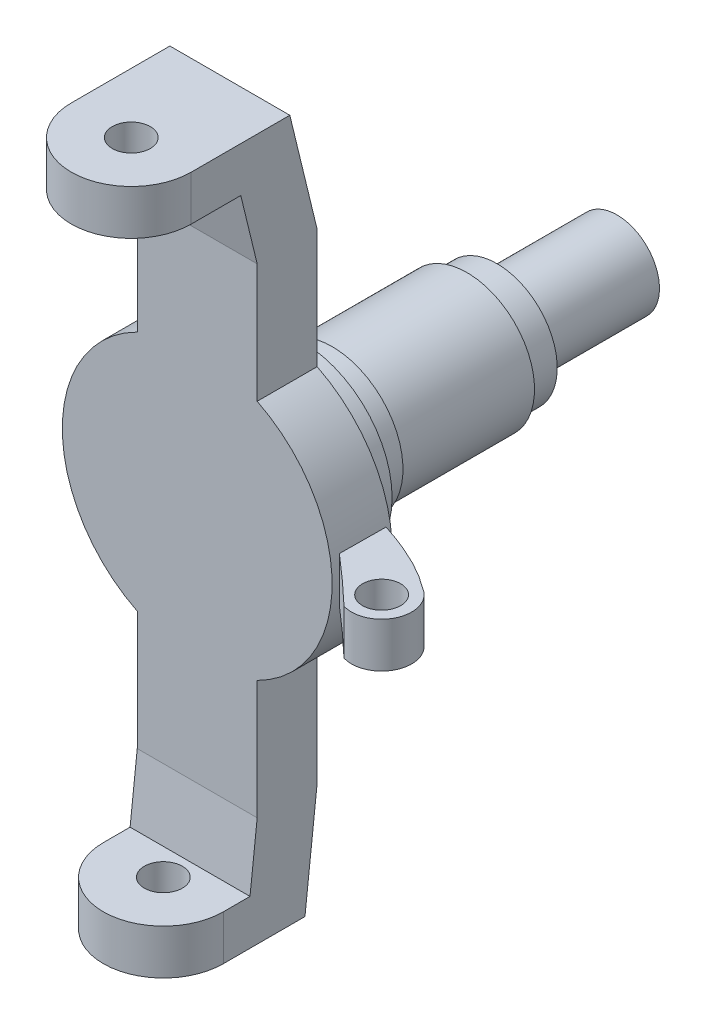
ISO-10303-21;
HEADER;
FILE_DESCRIPTION(('STEP AP214'),'2;1');
FILE_NAME('part.step','',(''),(''),'','','');
FILE_SCHEMA(('AUTOMOTIVE_DESIGN { 1 0 10303 214 1 1 1 1 }'));
ENDSEC;
DATA;
#1=APPLICATION_CONTEXT('core data for automotive mechanical design processes');
#2=APPLICATION_PROTOCOL_DEFINITION('international standard','automotive_design',2000,#1);
#3=PRODUCT_CONTEXT('',#1,'mechanical');
#4=PRODUCT('Part','Part','',(#3));
#5=PRODUCT_RELATED_PRODUCT_CATEGORY('part','',(#4));
#6=PRODUCT_DEFINITION_FORMATION('','',#4);
#7=PRODUCT_DEFINITION_CONTEXT('part definition',#1,'design');
#8=PRODUCT_DEFINITION('design','',#6,#7);
#9=PRODUCT_DEFINITION_SHAPE('','',#8);
#10=(LENGTH_UNIT() NAMED_UNIT(*) SI_UNIT(.MILLI.,.METRE.));
#11=(NAMED_UNIT(*) PLANE_ANGLE_UNIT() SI_UNIT($,.RADIAN.));
#12=(NAMED_UNIT(*) SI_UNIT($,.STERADIAN.) SOLID_ANGLE_UNIT());
#13=UNCERTAINTY_MEASURE_WITH_UNIT(LENGTH_MEASURE(1.E-05),#10,'distance_accuracy_value','');
#14=(GEOMETRIC_REPRESENTATION_CONTEXT(3) GLOBAL_UNCERTAINTY_ASSIGNED_CONTEXT((#13)) GLOBAL_UNIT_ASSIGNED_CONTEXT((#10,
#11,#12)) REPRESENTATION_CONTEXT('',''));
#15=CARTESIAN_POINT('',(0.,0.,0.));
#16=DIRECTION('',(0.,0.,1.));
#17=DIRECTION('',(1.,0.,0.));
#18=AXIS2_PLACEMENT_3D('',#15,#16,#17);
#19=CARTESIAN_POINT('',(0.,0.,20.));
#20=DIRECTION('',(0.,0.,-1.));
#21=DIRECTION('',(-1.,0.,0.));
#22=AXIS2_PLACEMENT_3D('',#19,#20,#21);
#23=CYLINDRICAL_SURFACE('',#22,45.);
#24=CARTESIAN_POINT('',(0.,0.,0.));
#25=DIRECTION('',(0.,0.,1.));
#26=DIRECTION('',(1.,0.,0.));
#27=AXIS2_PLACEMENT_3D('',#24,#25,#26);
#28=CIRCLE('',#27,45.);
#29=CARTESIAN_POINT('',(20.,-40.3112887414928,0.));
#30=VERTEX_POINT('',#29);
#31=CARTESIAN_POINT('',(20.,40.3112887414928,0.));
#32=VERTEX_POINT('',#31);
#33=EDGE_CURVE('E421',#30,#32,#28,.T.);
#34=ORIENTED_EDGE('',*,*,#33,.T.);
#35=DIRECTION('',(0.,0.,-1.));
#36=VECTOR('',#35,1.);
#37=CARTESIAN_POINT('',(20.,40.3112887414928,20.));
#38=LINE('',#37,#36);
#39=CARTESIAN_POINT('',(20.,40.3112887414928,20.));
#40=VERTEX_POINT('',#39);
#41=EDGE_CURVE('E403',#40,#32,#38,.T.);
#42=ORIENTED_EDGE('',*,*,#41,.F.);
#43=CARTESIAN_POINT('',(0.,0.,20.));
#44=DIRECTION('',(0.,0.,1.));
#45=DIRECTION('',(1.,0.,0.));
#46=AXIS2_PLACEMENT_3D('',#43,#44,#45);
#47=CIRCLE('',#46,45.);
#48=CARTESIAN_POINT('',(20.,-40.3112887414928,20.));
#49=VERTEX_POINT('',#48);
#50=EDGE_CURVE('E392',#49,#40,#47,.T.);
#51=ORIENTED_EDGE('',*,*,#50,.F.);
#52=DIRECTION('',(0.,0.,-1.));
#53=VECTOR('',#52,1.);
#54=CARTESIAN_POINT('',(20.,-40.3112887414928,20.));
#55=LINE('',#54,#53);
#56=EDGE_CURVE('E433',#49,#30,#55,.T.);
#57=ORIENTED_EDGE('',*,*,#56,.T.);
#58=EDGE_LOOP('',(#34,#42,#51,#57));
#59=FACE_BOUND('',#58,.T.);
#60=CARTESIAN_POINT('',(44.8761239337926,3.33669007833939,17.4637035465509));
#61=CARTESIAN_POINT('',(44.8926492553019,3.11444304827886,17.4778685760847));
#62=CARTESIAN_POINT('',(44.907529226522,2.8919837300049,17.4906251527411));
#63=CARTESIAN_POINT('',(44.9339677035822,2.44706389206436,17.5132931909466));
#64=CARTESIAN_POINT('',(44.945531232679,2.22460389005832,17.5232089553139));
#65=CARTESIAN_POINT('',(44.9653451122204,1.77968318127924,17.5402006401387));
#66=CARTESIAN_POINT('',(44.9735992355718,1.55722276610719,17.547279794484));
#67=CARTESIAN_POINT('',(44.9868011568031,1.11230177466959,17.5586029281942));
#68=CARTESIAN_POINT('',(44.9917514734423,0.889841328122935,17.562849067395));
#69=CARTESIAN_POINT('',(44.9983502638763,0.444920566049318,17.5685092680467));
#70=CARTESIAN_POINT('',(45.,0.222460283024659,17.5699244122303));
#71=CARTESIAN_POINT('',(45.,-0.222460283024659,17.5699244122303));
#72=CARTESIAN_POINT('',(44.9983502638763,-0.444920566049318,17.5685092680467));
#73=CARTESIAN_POINT('',(44.9917514734423,-0.889841328122935,17.562849067395));
#74=CARTESIAN_POINT('',(44.9868011568031,-1.11230177466959,17.5586029281942));
#75=CARTESIAN_POINT('',(44.9735992355718,-1.55722276610719,17.547279794484));
#76=CARTESIAN_POINT('',(44.9653451122204,-1.77968318127924,17.5402006401387));
#77=CARTESIAN_POINT('',(44.945531232679,-2.22460389005832,17.5232089553139));
#78=CARTESIAN_POINT('',(44.9339677035822,-2.44706389206436,17.5132931909466));
#79=CARTESIAN_POINT('',(44.907529226522,-2.8919837300049,17.4906251527411));
#80=CARTESIAN_POINT('',(44.8926492553019,-3.11444304827887,17.4778685760847));
#81=CARTESIAN_POINT('',(44.8761239337926,-3.33669007833939,17.4637035465509));
#82=B_SPLINE_CURVE_WITH_KNOTS('',3,(#60,#61,#62,#63,#64,#65,#66,#67,#68,#69,#70,#71,#72,#73,#74,
#75,#76,#77,#78,#79,#80,#81),.UNSPECIFIED.,.F.,.F.,(4,2,2,2,2,2,2,2,2,2,4),(0.,
0.669920468241517,1.33882081542183,2.00695639568449,2.67458201848366,3.34195225458838,
4.0093224906931,4.67694811349227,5.34508369375493,6.01398404093525,6.68390450917676),.UNSPECIFIED.);
#83=CARTESIAN_POINT('',(44.8761239337926,3.33669007833952,17.4637035465509));
#84=VERTEX_POINT('',#83);
#85=CARTESIAN_POINT('',(44.8761239337926,-3.33669007833952,17.4637035465509));
#86=VERTEX_POINT('',#85);
#87=EDGE_CURVE('E11',#84,#86,#82,.T.);
#88=ORIENTED_EDGE('',*,*,#87,.F.);
#89=CARTESIAN_POINT('',(0.,0.,5612.66610197562));
#90=DIRECTION('',(0.999967837623821,0.,0.00802020685142907));
#91=DIRECTION('',(0.00802020685142907,0.,-0.999967837623821));
#92=AXIS2_PLACEMENT_3D('',#89,#90,#91);
#93=ELLIPSE('',#92,5610.82785439402,45.);
#94=CARTESIAN_POINT('',(45.,0.,2.01870513772473));
#95=VERTEX_POINT('',#94);
#96=EDGE_CURVE('E61',#95,#84,#93,.T.);
#97=ORIENTED_EDGE('',*,*,#96,.F.);
#98=EDGE_CURVE('E70',#86,#95,#93,.T.);
#99=ORIENTED_EDGE('',*,*,#98,.F.);
#100=EDGE_LOOP('',(#88,#97,#99));
#101=FACE_BOUND('',#100,.T.);
#102=ADVANCED_FACE('F46',(#59,#101),#23,.T.);
#103=CARTESIAN_POINT('',(-20.,0.,20.));
#104=DIRECTION('',(1.,0.,0.));
#105=DIRECTION('',(0.,1.,0.));
#106=AXIS2_PLACEMENT_3D('',#103,#104,#105);
#107=PLANE('',#106);
#108=DIRECTION('',(0.,1.,0.));
#109=VECTOR('',#108,1.);
#110=CARTESIAN_POINT('',(-20.,-221.5,31.3));
#111=LINE('',#110,#109);
#112=CARTESIAN_POINT('',(-20.,-116.5,31.3));
#113=VERTEX_POINT('',#112);
#114=CARTESIAN_POINT('',(-20.,-101.5,31.3));
#115=VERTEX_POINT('',#114);
#116=EDGE_CURVE('E228',#113,#115,#111,.T.);
#117=ORIENTED_EDGE('',*,*,#116,.T.);
#118=DIRECTION('',(0.,0.,1.));
#119=VECTOR('',#118,1.);
#120=CARTESIAN_POINT('',(-20.,-101.5,57.1461758777978));
#121=LINE('',#120,#119);
#122=CARTESIAN_POINT('',(-20.,-101.5,22.39492945794));
#123=VERTEX_POINT('',#122);
#124=EDGE_CURVE('E305',#123,#115,#121,.T.);
#125=ORIENTED_EDGE('',*,*,#124,.F.);
#126=DIRECTION('',(0.,-0.99385304924073,0.110707346255353));
#127=VECTOR('',#126,1.);
#128=CARTESIAN_POINT('',(-20.,-101.5,22.39492945794));
#129=LINE('',#128,#127);
#130=CARTESIAN_POINT('',(-20.,-80.,20.));
#131=VERTEX_POINT('',#130);
#132=EDGE_CURVE('E284',#131,#123,#129,.T.);
#133=ORIENTED_EDGE('',*,*,#132,.F.);
#134=DIRECTION('',(0.,-1.,0.));
#135=VECTOR('',#134,1.);
#136=CARTESIAN_POINT('',(-20.,0.,20.));
#137=LINE('',#136,#135);
#138=CARTESIAN_POINT('',(-20.,-40.3112887414928,20.));
#139=VERTEX_POINT('',#138);
#140=EDGE_CURVE('E382',#139,#131,#137,.T.);
#141=ORIENTED_EDGE('',*,*,#140,.F.);
#142=DIRECTION('',(0.,0.,-1.));
#143=VECTOR('',#142,1.);
#144=CARTESIAN_POINT('',(-20.,-40.3112887414928,20.));
#145=LINE('',#144,#143);
#146=CARTESIAN_POINT('',(-20.,-40.3112887414928,0.));
#147=VERTEX_POINT('',#146);
#148=EDGE_CURVE('E436',#139,#147,#145,.T.);
#149=ORIENTED_EDGE('',*,*,#148,.T.);
#150=DIRECTION('',(0.,-1.,0.));
#151=VECTOR('',#150,1.);
#152=CARTESIAN_POINT('',(-20.,0.,0.));
#153=LINE('',#152,#151);
#154=CARTESIAN_POINT('',(-20.,-80.,0.));
#155=VERTEX_POINT('',#154);
#156=EDGE_CURVE('E410',#147,#155,#153,.T.);
#157=ORIENTED_EDGE('',*,*,#156,.T.);
#158=DIRECTION('',(0.,0.99385304924073,-0.110707346255353));
#159=VECTOR('',#158,1.);
#160=CARTESIAN_POINT('',(-20.,-80.,0.));
#161=LINE('',#160,#159);
#162=CARTESIAN_POINT('',(-20.,-116.5,4.06581047510739));
#163=VERTEX_POINT('',#162);
#164=EDGE_CURVE('E290',#163,#155,#161,.T.);
#165=ORIENTED_EDGE('',*,*,#164,.F.);
#166=DIRECTION('',(0.,0.,-1.));
#167=VECTOR('',#166,1.);
#168=CARTESIAN_POINT('',(-20.,-116.5,4.06581047510739));
#169=LINE('',#168,#167);
#170=EDGE_CURVE('E309',#113,#163,#169,.T.);
#171=ORIENTED_EDGE('',*,*,#170,.F.);
#172=EDGE_LOOP('',(#117,#125,#133,#141,#149,#157,#165,#171));
#173=FACE_BOUND('',#172,.T.);
#174=ADVANCED_FACE('F549',(#173),#107,.F.);
#175=CARTESIAN_POINT('',(20.,0.,20.));
#176=DIRECTION('',(1.,0.,0.));
#177=DIRECTION('',(0.,1.,0.));
#178=AXIS2_PLACEMENT_3D('',#175,#176,#177);
#179=PLANE('',#178);
#180=DIRECTION('',(0.,0.,1.));
#181=VECTOR('',#180,1.);
#182=CARTESIAN_POINT('',(20.,-101.5,57.1461758777978));
#183=LINE('',#182,#181);
#184=CARTESIAN_POINT('',(20.,-101.5,22.39492945794));
#185=VERTEX_POINT('',#184);
#186=CARTESIAN_POINT('',(20.,-101.5,31.3));
#187=VERTEX_POINT('',#186);
#188=EDGE_CURVE('E289',#185,#187,#183,.T.);
#189=ORIENTED_EDGE('',*,*,#188,.T.);
#190=DIRECTION('',(0.,1.,0.));
#191=VECTOR('',#190,1.);
#192=CARTESIAN_POINT('',(20.,-221.5,31.3));
#193=LINE('',#192,#191);
#194=CARTESIAN_POINT('',(20.,-116.5,31.3));
#195=VERTEX_POINT('',#194);
#196=EDGE_CURVE('E234',#195,#187,#193,.T.);
#197=ORIENTED_EDGE('',*,*,#196,.F.);
#198=DIRECTION('',(0.,0.,-1.));
#199=VECTOR('',#198,1.);
#200=CARTESIAN_POINT('',(20.,-116.5,4.06581047510739));
#201=LINE('',#200,#199);
#202=CARTESIAN_POINT('',(20.,-116.5,4.06581047510739));
#203=VERTEX_POINT('',#202);
#204=EDGE_CURVE('E294',#195,#203,#201,.T.);
#205=ORIENTED_EDGE('',*,*,#204,.T.);
#206=DIRECTION('',(0.,0.99385304924073,-0.110707346255353));
#207=VECTOR('',#206,1.);
#208=CARTESIAN_POINT('',(20.,-80.,0.));
#209=LINE('',#208,#207);
#210=CARTESIAN_POINT('',(20.,-80.,0.));
#211=VERTEX_POINT('',#210);
#212=EDGE_CURVE('E297',#203,#211,#209,.T.);
#213=ORIENTED_EDGE('',*,*,#212,.T.);
#214=DIRECTION('',(0.,-1.,0.));
#215=VECTOR('',#214,1.);
#216=CARTESIAN_POINT('',(20.,0.,0.));
#217=LINE('',#216,#215);
#218=EDGE_CURVE('E418',#30,#211,#217,.T.);
#219=ORIENTED_EDGE('',*,*,#218,.F.);
#220=ORIENTED_EDGE('',*,*,#56,.F.);
#221=DIRECTION('',(0.,-1.,0.));
#222=VECTOR('',#221,1.);
#223=CARTESIAN_POINT('',(20.,0.,20.));
#224=LINE('',#223,#222);
#225=CARTESIAN_POINT('',(20.,-80.,20.));
#226=VERTEX_POINT('',#225);
#227=EDGE_CURVE('E388',#49,#226,#224,.T.);
#228=ORIENTED_EDGE('',*,*,#227,.T.);
#229=DIRECTION('',(0.,-0.99385304924073,0.110707346255353));
#230=VECTOR('',#229,1.);
#231=CARTESIAN_POINT('',(20.,-101.5,22.39492945794));
#232=LINE('',#231,#230);
#233=EDGE_CURVE('E285',#226,#185,#232,.T.);
#234=ORIENTED_EDGE('',*,*,#233,.T.);
#235=EDGE_LOOP('',(#189,#197,#205,#213,#219,#220,#228,#234));
#236=FACE_BOUND('',#235,.T.);
#237=ADVANCED_FACE('F554',(#236),#179,.T.);
#238=CARTESIAN_POINT('',(-20.,0.,20.));
#239=DIRECTION('',(1.,0.,0.));
#240=DIRECTION('',(0.,1.,0.));
#241=AXIS2_PLACEMENT_3D('',#238,#239,#240);
#242=PLANE('',#241);
#243=DIRECTION('',(0.,1.,0.));
#244=VECTOR('',#243,1.);
#245=CARTESIAN_POINT('',(-20.,77.5,42.));
#246=LINE('',#245,#244);
#247=CARTESIAN_POINT('',(-20.,102.5,42.));
#248=VERTEX_POINT('',#247);
#249=CARTESIAN_POINT('',(-20.,117.5,42.));
#250=VERTEX_POINT('',#249);
#251=EDGE_CURVE('E330',#248,#250,#246,.T.);
#252=ORIENTED_EDGE('',*,*,#251,.T.);
#253=DIRECTION('',(0.,0.,1.));
#254=VECTOR('',#253,1.);
#255=CARTESIAN_POINT('',(-20.,117.5,9.116936513606));
#256=LINE('',#255,#254);
#257=CARTESIAN_POINT('',(-20.,117.5,9.116936513606));
#258=VERTEX_POINT('',#257);
#259=EDGE_CURVE('E360',#258,#250,#256,.T.);
#260=ORIENTED_EDGE('',*,*,#259,.F.);
#261=DIRECTION('',(0.,0.971695476529047,0.236236959201959));
#262=VECTOR('',#261,1.);
#263=CARTESIAN_POINT('',(-20.,80.,0.));
#264=LINE('',#263,#262);
#265=CARTESIAN_POINT('',(-20.,80.,0.));
#266=VERTEX_POINT('',#265);
#267=EDGE_CURVE('E357',#266,#258,#264,.T.);
#268=ORIENTED_EDGE('',*,*,#267,.F.);
#269=DIRECTION('',(0.,-1.,0.));
#270=VECTOR('',#269,1.);
#271=CARTESIAN_POINT('',(-20.,0.,0.));
#272=LINE('',#271,#270);
#273=CARTESIAN_POINT('',(-20.,40.3112887414928,0.));
#274=VERTEX_POINT('',#273);
#275=EDGE_CURVE('E373',#266,#274,#272,.T.);
#276=ORIENTED_EDGE('',*,*,#275,.T.);
#277=DIRECTION('',(0.,0.,-1.));
#278=VECTOR('',#277,1.);
#279=CARTESIAN_POINT('',(-20.,40.3112887414928,20.));
#280=LINE('',#279,#278);
#281=CARTESIAN_POINT('',(-20.,40.3112887414928,20.));
#282=VERTEX_POINT('',#281);
#283=EDGE_CURVE('E440',#282,#274,#280,.T.);
#284=ORIENTED_EDGE('',*,*,#283,.F.);
#285=DIRECTION('',(0.,-1.,0.));
#286=VECTOR('',#285,1.);
#287=CARTESIAN_POINT('',(-20.,0.,20.));
#288=LINE('',#287,#286);
#289=CARTESIAN_POINT('',(-20.,80.,20.));
#290=VERTEX_POINT('',#289);
#291=EDGE_CURVE('E374',#290,#282,#288,.T.);
#292=ORIENTED_EDGE('',*,*,#291,.F.);
#293=DIRECTION('',(0.,-0.971695476529047,-0.236236959201959));
#294=VECTOR('',#293,1.);
#295=CARTESIAN_POINT('',(-20.,102.5,25.4701619081636));
#296=LINE('',#295,#294);
#297=CARTESIAN_POINT('',(-20.,102.5,25.4701619081636));
#298=VERTEX_POINT('',#297);
#299=EDGE_CURVE('E334',#298,#290,#296,.T.);
#300=ORIENTED_EDGE('',*,*,#299,.F.);
#301=DIRECTION('',(0.,0.,-1.));
#302=VECTOR('',#301,1.);
#303=CARTESIAN_POINT('',(-20.,102.5,63.9164686158472));
#304=LINE('',#303,#302);
#305=EDGE_CURVE('E343',#248,#298,#304,.T.);
#306=ORIENTED_EDGE('',*,*,#305,.F.);
#307=EDGE_LOOP('',(#252,#260,#268,#276,#284,#292,#300,#306));
#308=FACE_BOUND('',#307,.T.);
#309=ADVANCED_FACE('F48',(#308),#242,.F.);
#310=CARTESIAN_POINT('',(20.,0.,20.));
#311=DIRECTION('',(1.,0.,0.));
#312=DIRECTION('',(0.,1.,0.));
#313=AXIS2_PLACEMENT_3D('',#310,#311,#312);
#314=PLANE('',#313);
#315=DIRECTION('',(0.,0.,1.));
#316=VECTOR('',#315,1.);
#317=CARTESIAN_POINT('',(20.,117.5,9.116936513606));
#318=LINE('',#317,#316);
#319=CARTESIAN_POINT('',(20.,117.5,9.116936513606));
#320=VERTEX_POINT('',#319);
#321=CARTESIAN_POINT('',(20.,117.5,42.));
#322=VERTEX_POINT('',#321);
#323=EDGE_CURVE('E346',#320,#322,#318,.T.);
#324=ORIENTED_EDGE('',*,*,#323,.T.);
#325=DIRECTION('',(0.,1.,0.));
#326=VECTOR('',#325,1.);
#327=CARTESIAN_POINT('',(20.,77.5,42.));
#328=LINE('',#327,#326);
#329=CARTESIAN_POINT('',(20.,102.5,42.));
#330=VERTEX_POINT('',#329);
#331=EDGE_CURVE('E331',#330,#322,#328,.T.);
#332=ORIENTED_EDGE('',*,*,#331,.F.);
#333=DIRECTION('',(0.,0.,-1.));
#334=VECTOR('',#333,1.);
#335=CARTESIAN_POINT('',(20.,102.5,63.9164686158472));
#336=LINE('',#335,#334);
#337=CARTESIAN_POINT('',(20.,102.5,25.4701619081636));
#338=VERTEX_POINT('',#337);
#339=EDGE_CURVE('E350',#330,#338,#336,.T.);
#340=ORIENTED_EDGE('',*,*,#339,.T.);
#341=DIRECTION('',(0.,-0.971695476529047,-0.236236959201959));
#342=VECTOR('',#341,1.);
#343=CARTESIAN_POINT('',(20.,102.5,25.4701619081636));
#344=LINE('',#343,#342);
#345=CARTESIAN_POINT('',(20.,80.,20.));
#346=VERTEX_POINT('',#345);
#347=EDGE_CURVE('E338',#338,#346,#344,.T.);
#348=ORIENTED_EDGE('',*,*,#347,.T.);
#349=DIRECTION('',(0.,-1.,0.));
#350=VECTOR('',#349,1.);
#351=CARTESIAN_POINT('',(20.,0.,20.));
#352=LINE('',#351,#350);
#353=EDGE_CURVE('E395',#346,#40,#352,.T.);
#354=ORIENTED_EDGE('',*,*,#353,.T.);
#355=ORIENTED_EDGE('',*,*,#41,.T.);
#356=DIRECTION('',(0.,-1.,0.));
#357=VECTOR('',#356,1.);
#358=CARTESIAN_POINT('',(20.,0.,0.));
#359=LINE('',#358,#357);
#360=CARTESIAN_POINT('',(20.,80.,0.));
#361=VERTEX_POINT('',#360);
#362=EDGE_CURVE('E425',#361,#32,#359,.T.);
#363=ORIENTED_EDGE('',*,*,#362,.F.);
#364=DIRECTION('',(0.,0.971695476529047,0.236236959201959));
#365=VECTOR('',#364,1.);
#366=CARTESIAN_POINT('',(20.,80.,0.));
#367=LINE('',#366,#365);
#368=EDGE_CURVE('E342',#361,#320,#367,.T.);
#369=ORIENTED_EDGE('',*,*,#368,.T.);
#370=EDGE_LOOP('',(#324,#332,#340,#348,#354,#355,#363,#369));
#371=FACE_BOUND('',#370,.T.);
#372=ADVANCED_FACE('F560',(#371),#314,.T.);
#373=CARTESIAN_POINT('',(0.,0.,20.));
#374=DIRECTION('',(0.,0.,-1.));
#375=DIRECTION('',(-1.,0.,0.));
#376=AXIS2_PLACEMENT_3D('',#373,#374,#375);
#377=CYLINDRICAL_SURFACE('',#376,45.);
#378=CARTESIAN_POINT('',(0.,0.,0.));
#379=DIRECTION('',(0.,0.,1.));
#380=DIRECTION('',(1.,0.,0.));
#381=AXIS2_PLACEMENT_3D('',#378,#379,#380);
#382=CIRCLE('',#381,45.);
#383=EDGE_CURVE('E407',#274,#147,#382,.T.);
#384=ORIENTED_EDGE('',*,*,#383,.T.);
#385=ORIENTED_EDGE('',*,*,#148,.F.);
#386=CARTESIAN_POINT('',(0.,0.,20.));
#387=DIRECTION('',(0.,0.,1.));
#388=DIRECTION('',(1.,0.,0.));
#389=AXIS2_PLACEMENT_3D('',#386,#387,#388);
#390=CIRCLE('',#389,45.);
#391=EDGE_CURVE('E378',#282,#139,#390,.T.);
#392=ORIENTED_EDGE('',*,*,#391,.F.);
#393=ORIENTED_EDGE('',*,*,#283,.T.);
#394=EDGE_LOOP('',(#384,#385,#392,#393));
#395=FACE_BOUND('',#394,.T.);
#396=ADVANCED_FACE('F564',(#395),#377,.T.);
#397=CARTESIAN_POINT('',(0.,0.,20.));
#398=DIRECTION('',(0.,0.,1.));
#399=DIRECTION('',(1.,0.,0.));
#400=AXIS2_PLACEMENT_3D('',#397,#398,#399);
#401=PLANE('',#400);
#402=ORIENTED_EDGE('',*,*,#291,.T.);
#403=ORIENTED_EDGE('',*,*,#391,.T.);
#404=ORIENTED_EDGE('',*,*,#140,.T.);
#405=DIRECTION('',(1.,0.,0.));
#406=VECTOR('',#405,1.);
#407=CARTESIAN_POINT('',(0.,-80.,20.));
#408=LINE('',#407,#406);
#409=EDGE_CURVE('E385',#131,#226,#408,.T.);
#410=ORIENTED_EDGE('',*,*,#409,.T.);
#411=ORIENTED_EDGE('',*,*,#227,.F.);
#412=ORIENTED_EDGE('',*,*,#50,.T.);
#413=ORIENTED_EDGE('',*,*,#353,.F.);
#414=DIRECTION('',(1.,0.,0.));
#415=VECTOR('',#414,1.);
#416=CARTESIAN_POINT('',(0.,80.,20.));
#417=LINE('',#416,#415);
#418=EDGE_CURVE('E399',#290,#346,#417,.T.);
#419=ORIENTED_EDGE('',*,*,#418,.F.);
#420=EDGE_LOOP('',(#402,#403,#404,#410,#411,#412,#413,#419));
#421=FACE_BOUND('',#420,.T.);
#422=ADVANCED_FACE('F566',(#421),#401,.T.);
#423=CARTESIAN_POINT('',(0.,0.,0.));
#424=DIRECTION('',(0.,0.,1.));
#425=DIRECTION('',(1.,0.,0.));
#426=AXIS2_PLACEMENT_3D('',#423,#424,#425);
#427=PLANE('',#426);
#428=CARTESIAN_POINT('',(0.,0.,0.));
#429=DIRECTION('',(0.,0.,1.));
#430=DIRECTION('',(1.,0.,0.));
#431=AXIS2_PLACEMENT_3D('',#428,#429,#430);
#432=CIRCLE('',#431,30.);
#433=CARTESIAN_POINT('',(30.,0.,0.));
#434=VERTEX_POINT('',#433);
#435=EDGE_CURVE('E448',#434,#434,#432,.F.);
#436=ORIENTED_EDGE('',*,*,#435,.F.);
#437=EDGE_LOOP('',(#436));
#438=FACE_BOUND('',#437,.T.);
#439=ORIENTED_EDGE('',*,*,#275,.F.);
#440=DIRECTION('',(1.,0.,0.));
#441=VECTOR('',#440,1.);
#442=CARTESIAN_POINT('',(0.,80.,0.));
#443=LINE('',#442,#441);
#444=EDGE_CURVE('E379',#266,#361,#443,.T.);
#445=ORIENTED_EDGE('',*,*,#444,.T.);
#446=ORIENTED_EDGE('',*,*,#362,.T.);
#447=ORIENTED_EDGE('',*,*,#33,.F.);
#448=ORIENTED_EDGE('',*,*,#218,.T.);
#449=DIRECTION('',(1.,0.,0.));
#450=VECTOR('',#449,1.);
#451=CARTESIAN_POINT('',(0.,-80.,0.));
#452=LINE('',#451,#450);
#453=EDGE_CURVE('E414',#155,#211,#452,.T.);
#454=ORIENTED_EDGE('',*,*,#453,.F.);
#455=ORIENTED_EDGE('',*,*,#156,.F.);
#456=ORIENTED_EDGE('',*,*,#383,.F.);
#457=EDGE_LOOP('',(#439,#445,#446,#447,#448,#454,#455,#456));
#458=FACE_BOUND('',#457,.T.);
#459=ADVANCED_FACE('F572',(#438,#458),#427,.F.);
#460=CARTESIAN_POINT('',(20.,102.5,25.4701619081636));
#461=DIRECTION('',(0.,0.236236959201959,-0.971695476529047));
#462=DIRECTION('',(0.,0.971695476529047,0.236236959201959));
#463=AXIS2_PLACEMENT_3D('',#460,#461,#462);
#464=PLANE('',#463);
#465=ORIENTED_EDGE('',*,*,#299,.T.);
#466=ORIENTED_EDGE('',*,*,#418,.T.);
#467=ORIENTED_EDGE('',*,*,#347,.F.);
#468=DIRECTION('',(-1.,0.,0.));
#469=VECTOR('',#468,1.);
#470=CARTESIAN_POINT('',(20.,102.5,25.4701619081636));
#471=LINE('',#470,#469);
#472=EDGE_CURVE('E353',#338,#298,#471,.T.);
#473=ORIENTED_EDGE('',*,*,#472,.T.);
#474=EDGE_LOOP('',(#465,#466,#467,#473));
#475=FACE_BOUND('',#474,.T.);
#476=ADVANCED_FACE('F612',(#475),#464,.F.);
#477=CARTESIAN_POINT('',(20.,80.,0.));
#478=DIRECTION('',(0.,-0.236236959201959,0.971695476529047));
#479=DIRECTION('',(0.,-0.971695476529047,-0.236236959201959));
#480=AXIS2_PLACEMENT_3D('',#477,#478,#479);
#481=PLANE('',#480);
#482=ORIENTED_EDGE('',*,*,#267,.T.);
#483=DIRECTION('',(-1.,0.,0.));
#484=VECTOR('',#483,1.);
#485=CARTESIAN_POINT('',(20.,117.5,9.116936513606));
#486=LINE('',#485,#484);
#487=EDGE_CURVE('E369',#320,#258,#486,.T.);
#488=ORIENTED_EDGE('',*,*,#487,.F.);
#489=ORIENTED_EDGE('',*,*,#368,.F.);
#490=ORIENTED_EDGE('',*,*,#444,.F.);
#491=EDGE_LOOP('',(#482,#488,#489,#490));
#492=FACE_BOUND('',#491,.T.);
#493=ADVANCED_FACE('F622',(#492),#481,.F.);
#494=CARTESIAN_POINT('',(20.,117.5,9.116936513606));
#495=DIRECTION('',(0.,-1.,0.));
#496=DIRECTION('',(0.,0.,-1.));
#497=AXIS2_PLACEMENT_3D('',#494,#495,#496);
#498=PLANE('',#497);
#499=CARTESIAN_POINT('',(0.,117.5,42.));
#500=DIRECTION('',(0.,1.,0.));
#501=DIRECTION('',(0.,0.,1.));
#502=AXIS2_PLACEMENT_3D('',#499,#500,#501);
#503=CIRCLE('',#502,6.35);
#504=CARTESIAN_POINT('',(0.,117.5,48.35));
#505=VERTEX_POINT('',#504);
#506=EDGE_CURVE('E322',#505,#505,#503,.T.);
#507=ORIENTED_EDGE('',*,*,#506,.F.);
#508=EDGE_LOOP('',(#507));
#509=FACE_BOUND('',#508,.T.);
#510=ORIENTED_EDGE('',*,*,#259,.T.);
#511=CARTESIAN_POINT('',(0.,117.5,42.));
#512=DIRECTION('',(0.,-1.,0.));
#513=DIRECTION('',(0.,0.,1.));
#514=AXIS2_PLACEMENT_3D('',#511,#512,#513);
#515=CIRCLE('',#514,20.);
#516=EDGE_CURVE('E327',#322,#250,#515,.T.);
#517=ORIENTED_EDGE('',*,*,#516,.F.);
#518=ORIENTED_EDGE('',*,*,#323,.F.);
#519=ORIENTED_EDGE('',*,*,#487,.T.);
#520=EDGE_LOOP('',(#510,#517,#518,#519));
#521=FACE_BOUND('',#520,.T.);
#522=ADVANCED_FACE('F627',(#509,#521),#498,.F.);
#523=CARTESIAN_POINT('',(20.,102.5,63.9164686158472));
#524=DIRECTION('',(0.,1.,0.));
#525=DIRECTION('',(0.,0.,1.));
#526=AXIS2_PLACEMENT_3D('',#523,#524,#525);
#527=PLANE('',#526);
#528=CARTESIAN_POINT('',(0.,102.5,42.));
#529=DIRECTION('',(0.,1.,0.));
#530=DIRECTION('',(0.,0.,1.));
#531=AXIS2_PLACEMENT_3D('',#528,#529,#530);
#532=CIRCLE('',#531,6.35);
#533=CARTESIAN_POINT('',(0.,102.5,48.35));
#534=VERTEX_POINT('',#533);
#535=EDGE_CURVE('E326',#534,#534,#532,.T.);
#536=ORIENTED_EDGE('',*,*,#535,.T.);
#537=EDGE_LOOP('',(#536));
#538=FACE_BOUND('',#537,.T.);
#539=ORIENTED_EDGE('',*,*,#339,.F.);
#540=CARTESIAN_POINT('',(0.,102.5,42.));
#541=DIRECTION('',(0.,1.,0.));
#542=DIRECTION('',(0.,0.,1.));
#543=AXIS2_PLACEMENT_3D('',#540,#541,#542);
#544=CIRCLE('',#543,20.);
#545=EDGE_CURVE('E444',#330,#248,#544,.F.);
#546=ORIENTED_EDGE('',*,*,#545,.T.);
#547=ORIENTED_EDGE('',*,*,#305,.T.);
#548=ORIENTED_EDGE('',*,*,#472,.F.);
#549=EDGE_LOOP('',(#539,#546,#547,#548));
#550=FACE_BOUND('',#549,.T.);
#551=ADVANCED_FACE('F631',(#538,#550),#527,.F.);
#552=CARTESIAN_POINT('',(0.,77.5,42.));
#553=DIRECTION('',(0.,1.,0.));
#554=DIRECTION('',(0.,0.,1.));
#555=AXIS2_PLACEMENT_3D('',#552,#553,#554);
#556=CYLINDRICAL_SURFACE('',#555,20.);
#557=ORIENTED_EDGE('',*,*,#331,.T.);
#558=ORIENTED_EDGE('',*,*,#516,.T.);
#559=ORIENTED_EDGE('',*,*,#251,.F.);
#560=ORIENTED_EDGE('',*,*,#545,.F.);
#561=EDGE_LOOP('',(#557,#558,#559,#560));
#562=FACE_BOUND('',#561,.T.);
#563=ADVANCED_FACE('F629',(#562),#556,.T.);
#564=CARTESIAN_POINT('',(0.,77.5,42.));
#565=DIRECTION('',(0.,1.,0.));
#566=DIRECTION('',(0.,0.,1.));
#567=AXIS2_PLACEMENT_3D('',#564,#565,#566);
#568=CYLINDRICAL_SURFACE('',#567,6.35);
#569=ORIENTED_EDGE('',*,*,#506,.T.);
#570=EDGE_LOOP('',(#569));
#571=FACE_BOUND('',#570,.T.);
#572=ORIENTED_EDGE('',*,*,#535,.F.);
#573=EDGE_LOOP('',(#572));
#574=FACE_BOUND('',#573,.T.);
#575=ADVANCED_FACE('F639',(#571,#574),#568,.F.);
#576=CARTESIAN_POINT('',(20.,-101.5,22.39492945794));
#577=DIRECTION('',(0.,-0.110707346255353,-0.99385304924073));
#578=DIRECTION('',(0.,0.99385304924073,-0.110707346255353));
#579=AXIS2_PLACEMENT_3D('',#576,#577,#578);
#580=PLANE('',#579);
#581=ORIENTED_EDGE('',*,*,#132,.T.);
#582=DIRECTION('',(-1.,0.,0.));
#583=VECTOR('',#582,1.);
#584=CARTESIAN_POINT('',(20.,-101.5,22.39492945794));
#585=LINE('',#584,#583);
#586=EDGE_CURVE('E318',#185,#123,#585,.T.);
#587=ORIENTED_EDGE('',*,*,#586,.F.);
#588=ORIENTED_EDGE('',*,*,#233,.F.);
#589=ORIENTED_EDGE('',*,*,#409,.F.);
#590=EDGE_LOOP('',(#581,#587,#588,#589));
#591=FACE_BOUND('',#590,.T.);
#592=ADVANCED_FACE('F602',(#591),#580,.F.);
#593=CARTESIAN_POINT('',(20.,-101.5,57.1461758777978));
#594=DIRECTION('',(0.,-1.,0.));
#595=DIRECTION('',(0.,0.,-1.));
#596=AXIS2_PLACEMENT_3D('',#593,#594,#595);
#597=PLANE('',#596);
#598=CARTESIAN_POINT('',(0.,-101.5,31.3));
#599=DIRECTION('',(0.,-1.,0.));
#600=DIRECTION('',(0.,0.,-1.));
#601=AXIS2_PLACEMENT_3D('',#598,#599,#600);
#602=CIRCLE('',#601,6.35);
#603=CARTESIAN_POINT('',(0.,-101.5,24.95));
#604=VERTEX_POINT('',#603);
#605=EDGE_CURVE('E280',#604,#604,#602,.T.);
#606=ORIENTED_EDGE('',*,*,#605,.T.);
#607=EDGE_LOOP('',(#606));
#608=FACE_BOUND('',#607,.T.);
#609=ORIENTED_EDGE('',*,*,#124,.T.);
#610=CARTESIAN_POINT('',(0.,-101.5,31.3));
#611=DIRECTION('',(0.,-1.,0.));
#612=DIRECTION('',(0.,0.,1.));
#613=AXIS2_PLACEMENT_3D('',#610,#611,#612);
#614=CIRCLE('',#613,20.);
#615=EDGE_CURVE('E224',#187,#115,#614,.T.);
#616=ORIENTED_EDGE('',*,*,#615,.F.);
#617=ORIENTED_EDGE('',*,*,#188,.F.);
#618=ORIENTED_EDGE('',*,*,#586,.T.);
#619=EDGE_LOOP('',(#609,#616,#617,#618));
#620=FACE_BOUND('',#619,.T.);
#621=ADVANCED_FACE('F599',(#608,#620),#597,.F.);
#622=CARTESIAN_POINT('',(20.,-116.5,4.06581047510739));
#623=DIRECTION('',(0.,1.,0.));
#624=DIRECTION('',(0.,0.,1.));
#625=AXIS2_PLACEMENT_3D('',#622,#623,#624);
#626=PLANE('',#625);
#627=CARTESIAN_POINT('',(0.,-116.5,31.3));
#628=DIRECTION('',(0.,-1.,0.));
#629=DIRECTION('',(0.,0.,-1.));
#630=AXIS2_PLACEMENT_3D('',#627,#628,#629);
#631=CIRCLE('',#630,6.35);
#632=CARTESIAN_POINT('',(0.,-116.5,24.95));
#633=VERTEX_POINT('',#632);
#634=EDGE_CURVE('E276',#633,#633,#631,.T.);
#635=ORIENTED_EDGE('',*,*,#634,.F.);
#636=EDGE_LOOP('',(#635));
#637=FACE_BOUND('',#636,.T.);
#638=ORIENTED_EDGE('',*,*,#204,.F.);
#639=CARTESIAN_POINT('',(0.,-116.5,31.3));
#640=DIRECTION('',(0.,1.,0.));
#641=DIRECTION('',(0.,0.,1.));
#642=AXIS2_PLACEMENT_3D('',#639,#640,#641);
#643=CIRCLE('',#642,20.);
#644=EDGE_CURVE('E455',#195,#113,#643,.F.);
#645=ORIENTED_EDGE('',*,*,#644,.T.);
#646=ORIENTED_EDGE('',*,*,#170,.T.);
#647=DIRECTION('',(-1.,0.,0.));
#648=VECTOR('',#647,1.);
#649=CARTESIAN_POINT('',(20.,-116.5,4.06581047510739));
#650=LINE('',#649,#648);
#651=EDGE_CURVE('E301',#203,#163,#650,.T.);
#652=ORIENTED_EDGE('',*,*,#651,.F.);
#653=EDGE_LOOP('',(#638,#645,#646,#652));
#654=FACE_BOUND('',#653,.T.);
#655=ADVANCED_FACE('F592',(#637,#654),#626,.F.);
#656=CARTESIAN_POINT('',(20.,-80.,0.));
#657=DIRECTION('',(0.,0.110707346255353,0.99385304924073));
#658=DIRECTION('',(0.,-0.99385304924073,0.110707346255353));
#659=AXIS2_PLACEMENT_3D('',#656,#657,#658);
#660=PLANE('',#659);
#661=ORIENTED_EDGE('',*,*,#164,.T.);
#662=ORIENTED_EDGE('',*,*,#453,.T.);
#663=ORIENTED_EDGE('',*,*,#212,.F.);
#664=ORIENTED_EDGE('',*,*,#651,.T.);
#665=EDGE_LOOP('',(#661,#662,#663,#664));
#666=FACE_BOUND('',#665,.T.);
#667=ADVANCED_FACE('F587',(#666),#660,.F.);
#668=CARTESIAN_POINT('',(0.,-76.5,31.3));
#669=DIRECTION('',(0.,-1.,0.));
#670=DIRECTION('',(0.,0.,-1.));
#671=AXIS2_PLACEMENT_3D('',#668,#669,#670);
#672=CYLINDRICAL_SURFACE('',#671,6.35);
#673=ORIENTED_EDGE('',*,*,#634,.T.);
#674=EDGE_LOOP('',(#673));
#675=FACE_BOUND('',#674,.T.);
#676=ORIENTED_EDGE('',*,*,#605,.F.);
#677=EDGE_LOOP('',(#676));
#678=FACE_BOUND('',#677,.T.);
#679=ADVANCED_FACE('F657',(#675,#678),#672,.F.);
#680=CARTESIAN_POINT('',(0.,0.,-15.));
#681=DIRECTION('',(0.,0.,1.));
#682=DIRECTION('',(1.,0.,0.));
#683=AXIS2_PLACEMENT_3D('',#680,#681,#682);
#684=CYLINDRICAL_SURFACE('',#683,30.);
#685=CARTESIAN_POINT('',(0.,0.,-15.));
#686=DIRECTION('',(0.,0.,-1.));
#687=DIRECTION('',(-1.,0.,0.));
#688=AXIS2_PLACEMENT_3D('',#685,#686,#687);
#689=CIRCLE('',#688,30.);
#690=CARTESIAN_POINT('',(-30.,0.,-15.));
#691=VERTEX_POINT('',#690);
#692=EDGE_CURVE('E272',#691,#691,#689,.T.);
#693=ORIENTED_EDGE('',*,*,#692,.F.);
#694=EDGE_LOOP('',(#693));
#695=FACE_BOUND('',#694,.T.);
#696=ORIENTED_EDGE('',*,*,#435,.T.);
#697=EDGE_LOOP('',(#696));
#698=FACE_BOUND('',#697,.T.);
#699=ADVANCED_FACE('F654',(#695,#698),#684,.T.);
#700=CARTESIAN_POINT('',(0.,0.,-15.));
#701=DIRECTION('',(0.,0.,-1.));
#702=DIRECTION('',(-1.,0.,0.));
#703=AXIS2_PLACEMENT_3D('',#700,#701,#702);
#704=PLANE('',#703);
#705=CARTESIAN_POINT('',(0.,0.,-15.));
#706=DIRECTION('',(0.,0.,-1.));
#707=DIRECTION('',(-1.,0.,0.));
#708=AXIS2_PLACEMENT_3D('',#705,#706,#707);
#709=CIRCLE('',#708,23.625);
#710=CARTESIAN_POINT('',(-23.625,0.,-15.));
#711=VERTEX_POINT('',#710);
#712=EDGE_CURVE('E268',#711,#711,#709,.T.);
#713=ORIENTED_EDGE('',*,*,#712,.F.);
#714=EDGE_LOOP('',(#713));
#715=FACE_BOUND('',#714,.T.);
#716=ORIENTED_EDGE('',*,*,#692,.T.);
#717=EDGE_LOOP('',(#716));
#718=FACE_BOUND('',#717,.T.);
#719=ADVANCED_FACE('F656',(#715,#718),#704,.T.);
#720=CARTESIAN_POINT('',(0.,0.,-25.));
#721=DIRECTION('',(0.,0.,1.));
#722=DIRECTION('',(1.,0.,0.));
#723=AXIS2_PLACEMENT_3D('',#720,#721,#722);
#724=CYLINDRICAL_SURFACE('',#723,23.625);
#725=ORIENTED_EDGE('',*,*,#712,.T.);
#726=EDGE_LOOP('',(#725));
#727=FACE_BOUND('',#726,.T.);
#728=CARTESIAN_POINT('',(0.,0.,-25.));
#729=DIRECTION('',(0.,0.,-1.));
#730=DIRECTION('',(-1.,0.,0.));
#731=AXIS2_PLACEMENT_3D('',#728,#729,#730);
#732=CIRCLE('',#731,23.625);
#733=CARTESIAN_POINT('',(-23.625,0.,-25.));
#734=VERTEX_POINT('',#733);
#735=EDGE_CURVE('E264',#734,#734,#732,.T.);
#736=ORIENTED_EDGE('',*,*,#735,.F.);
#737=EDGE_LOOP('',(#736));
#738=FACE_BOUND('',#737,.T.);
#739=ADVANCED_FACE('F664',(#727,#738),#724,.T.);
#740=CARTESIAN_POINT('',(0.,0.,-25.));
#741=DIRECTION('',(0.,0.,-1.));
#742=DIRECTION('',(-1.,0.,0.));
#743=AXIS2_PLACEMENT_3D('',#740,#741,#742);
#744=PLANE('',#743);
#745=CARTESIAN_POINT('',(0.,0.,-25.));
#746=DIRECTION('',(0.,0.,-1.));
#747=DIRECTION('',(-1.,0.,0.));
#748=AXIS2_PLACEMENT_3D('',#745,#746,#747);
#749=CIRCLE('',#748,22.5);
#750=CARTESIAN_POINT('',(-22.5,0.,-25.));
#751=VERTEX_POINT('',#750);
#752=EDGE_CURVE('E260',#751,#751,#749,.T.);
#753=ORIENTED_EDGE('',*,*,#752,.F.);
#754=EDGE_LOOP('',(#753));
#755=FACE_BOUND('',#754,.T.);
#756=ORIENTED_EDGE('',*,*,#735,.T.);
#757=EDGE_LOOP('',(#756));
#758=FACE_BOUND('',#757,.T.);
#759=ADVANCED_FACE('F730',(#755,#758),#744,.T.);
#760=CARTESIAN_POINT('',(0.,0.,-70.));
#761=DIRECTION('',(0.,0.,1.));
#762=DIRECTION('',(1.,0.,0.));
#763=AXIS2_PLACEMENT_3D('',#760,#761,#762);
#764=CYLINDRICAL_SURFACE('',#763,22.5);
#765=ORIENTED_EDGE('',*,*,#752,.T.);
#766=EDGE_LOOP('',(#765));
#767=FACE_BOUND('',#766,.T.);
#768=CARTESIAN_POINT('',(0.,0.,-70.));
#769=DIRECTION('',(0.,0.,-1.));
#770=DIRECTION('',(-1.,0.,0.));
#771=AXIS2_PLACEMENT_3D('',#768,#769,#770);
#772=CIRCLE('',#771,22.5);
#773=CARTESIAN_POINT('',(-22.5,0.,-70.));
#774=VERTEX_POINT('',#773);
#775=EDGE_CURVE('E256',#774,#774,#772,.T.);
#776=ORIENTED_EDGE('',*,*,#775,.F.);
#777=EDGE_LOOP('',(#776));
#778=FACE_BOUND('',#777,.T.);
#779=ADVANCED_FACE('F739',(#767,#778),#764,.T.);
#780=CARTESIAN_POINT('',(0.,0.,-70.));
#781=DIRECTION('',(0.,0.,-1.));
#782=DIRECTION('',(-1.,0.,0.));
#783=AXIS2_PLACEMENT_3D('',#780,#781,#782);
#784=PLANE('',#783);
#785=CARTESIAN_POINT('',(0.,0.,-70.));
#786=DIRECTION('',(0.,0.,-1.));
#787=DIRECTION('',(-1.,0.,0.));
#788=AXIS2_PLACEMENT_3D('',#785,#786,#787);
#789=CIRCLE('',#788,20.075);
#790=CARTESIAN_POINT('',(-20.075,0.,-70.));
#791=VERTEX_POINT('',#790);
#792=EDGE_CURVE('E252',#791,#791,#789,.T.);
#793=ORIENTED_EDGE('',*,*,#792,.F.);
#794=EDGE_LOOP('',(#793));
#795=FACE_BOUND('',#794,.T.);
#796=ORIENTED_EDGE('',*,*,#775,.T.);
#797=EDGE_LOOP('',(#796));
#798=FACE_BOUND('',#797,.T.);
#799=ADVANCED_FACE('F749',(#795,#798),#784,.T.);
#800=CARTESIAN_POINT('',(0.,0.,-80.));
#801=DIRECTION('',(0.,0.,1.));
#802=DIRECTION('',(1.,0.,0.));
#803=AXIS2_PLACEMENT_3D('',#800,#801,#802);
#804=CYLINDRICAL_SURFACE('',#803,20.075);
#805=ORIENTED_EDGE('',*,*,#792,.T.);
#806=EDGE_LOOP('',(#805));
#807=FACE_BOUND('',#806,.T.);
#808=CARTESIAN_POINT('',(0.,0.,-80.));
#809=DIRECTION('',(0.,0.,-1.));
#810=DIRECTION('',(-1.,0.,0.));
#811=AXIS2_PLACEMENT_3D('',#808,#809,#810);
#812=CIRCLE('',#811,20.075);
#813=CARTESIAN_POINT('',(-20.075,0.,-80.));
#814=VERTEX_POINT('',#813);
#815=EDGE_CURVE('E248',#814,#814,#812,.T.);
#816=ORIENTED_EDGE('',*,*,#815,.F.);
#817=EDGE_LOOP('',(#816));
#818=FACE_BOUND('',#817,.T.);
#819=ADVANCED_FACE('F759',(#807,#818),#804,.T.);
#820=CARTESIAN_POINT('',(0.,0.,-80.));
#821=DIRECTION('',(0.,0.,-1.));
#822=DIRECTION('',(-1.,0.,0.));
#823=AXIS2_PLACEMENT_3D('',#820,#821,#822);
#824=PLANE('',#823);
#825=CARTESIAN_POINT('',(0.,0.,-80.));
#826=DIRECTION('',(0.,0.,-1.));
#827=DIRECTION('',(-1.,0.,0.));
#828=AXIS2_PLACEMENT_3D('',#825,#826,#827);
#829=CIRCLE('',#828,14.175);
#830=CARTESIAN_POINT('',(-14.175,0.,-80.));
#831=VERTEX_POINT('',#830);
#832=EDGE_CURVE('E244',#831,#831,#829,.T.);
#833=ORIENTED_EDGE('',*,*,#832,.F.);
#834=EDGE_LOOP('',(#833));
#835=FACE_BOUND('',#834,.T.);
#836=ORIENTED_EDGE('',*,*,#815,.T.);
#837=EDGE_LOOP('',(#836));
#838=FACE_BOUND('',#837,.T.);
#839=ADVANCED_FACE('F769',(#835,#838),#824,.T.);
#840=CARTESIAN_POINT('',(0.,0.,-120.));
#841=DIRECTION('',(0.,0.,1.));
#842=DIRECTION('',(1.,0.,0.));
#843=AXIS2_PLACEMENT_3D('',#840,#841,#842);
#844=CYLINDRICAL_SURFACE('',#843,14.175);
#845=ORIENTED_EDGE('',*,*,#832,.T.);
#846=EDGE_LOOP('',(#845));
#847=FACE_BOUND('',#846,.T.);
#848=CARTESIAN_POINT('',(0.,0.,-120.));
#849=DIRECTION('',(0.,0.,-1.));
#850=DIRECTION('',(-1.,0.,0.));
#851=AXIS2_PLACEMENT_3D('',#848,#849,#850);
#852=CIRCLE('',#851,14.175);
#853=CARTESIAN_POINT('',(-14.175,0.,-120.));
#854=VERTEX_POINT('',#853);
#855=EDGE_CURVE('E237',#854,#854,#852,.T.);
#856=ORIENTED_EDGE('',*,*,#855,.F.);
#857=EDGE_LOOP('',(#856));
#858=FACE_BOUND('',#857,.T.);
#859=ADVANCED_FACE('F779',(#847,#858),#844,.T.);
#860=CARTESIAN_POINT('',(0.,0.,-120.));
#861=DIRECTION('',(0.,0.,-1.));
#862=DIRECTION('',(-1.,0.,0.));
#863=AXIS2_PLACEMENT_3D('',#860,#861,#862);
#864=PLANE('',#863);
#865=ORIENTED_EDGE('',*,*,#855,.T.);
#866=EDGE_LOOP('',(#865));
#867=FACE_BOUND('',#866,.T.);
#868=ADVANCED_FACE('F789',(#867),#864,.T.);
#869=CARTESIAN_POINT('',(0.,-221.5,31.3));
#870=DIRECTION('',(0.,1.,0.));
#871=DIRECTION('',(0.,0.,1.));
#872=AXIS2_PLACEMENT_3D('',#869,#870,#871);
#873=CYLINDRICAL_SURFACE('',#872,20.);
#874=ORIENTED_EDGE('',*,*,#196,.T.);
#875=ORIENTED_EDGE('',*,*,#615,.T.);
#876=ORIENTED_EDGE('',*,*,#116,.F.);
#877=ORIENTED_EDGE('',*,*,#644,.F.);
#878=EDGE_LOOP('',(#874,#875,#876,#877));
#879=FACE_BOUND('',#878,.T.);
#880=ADVANCED_FACE('F521',(#879),#873,.T.);
#881=CARTESIAN_POINT('',(44.8761239337926,7.5,17.4637035465509));
#882=CARTESIAN_POINT('',(53.4372196227846,7.5,24.8019835685791));
#883=CARTESIAN_POINT('',(60.8359556229126,7.5,31.8790353947883));
#884=B_SPLINE_CURVE_WITH_KNOTS('',2,(#881,#882,#883),.UNSPECIFIED.,.F.,.F.,(3,3),(0.,1.),.UNSPECIFIED.);
#885=DIRECTION('',(0.,-1.,0.));
#886=VECTOR('',#885,1.);
#887=SURFACE_OF_LINEAR_EXTRUSION('',#884,#886);
#888=DIRECTION('',(0.,-1.,0.));
#889=VECTOR('',#888,1.);
#890=CARTESIAN_POINT('',(44.8761239337926,7.5,17.4637035465509));
#891=LINE('',#890,#889);
#892=CARTESIAN_POINT('',(44.8761239337926,7.5,17.4637035465509));
#893=VERTEX_POINT('',#892);
#894=EDGE_CURVE('E466',#893,#84,#891,.T.);
#895=ORIENTED_EDGE('',*,*,#894,.T.);
#896=ORIENTED_EDGE('',*,*,#87,.T.);
#897=CARTESIAN_POINT('',(44.8761239337926,-7.5,17.4637035465509));
#898=VERTEX_POINT('',#897);
#899=EDGE_CURVE('E470',#86,#898,#891,.T.);
#900=ORIENTED_EDGE('',*,*,#899,.T.);
#901=CARTESIAN_POINT('',(44.8761239337926,-7.5,17.4637035465509));
#902=CARTESIAN_POINT('',(53.4372196227846,-7.5,24.8019835685791));
#903=CARTESIAN_POINT('',(60.8359556229126,-7.5,31.8790353947883));
#904=B_SPLINE_CURVE_WITH_KNOTS('',2,(#901,#902,#903),.UNSPECIFIED.,.F.,.F.,(3,3),(0.,1.),.UNSPECIFIED.);
#905=CARTESIAN_POINT('',(60.8359556229125,-7.5,31.8790353947883));
#906=VERTEX_POINT('',#905);
#907=EDGE_CURVE('E222',#898,#906,#904,.T.);
#908=ORIENTED_EDGE('',*,*,#907,.T.);
#909=DIRECTION('',(0.,-1.,0.));
#910=VECTOR('',#909,1.);
#911=CARTESIAN_POINT('',(60.8359556229125,7.5,31.8790353947883));
#912=LINE('',#911,#910);
#913=CARTESIAN_POINT('',(60.8359556229125,7.5,31.8790353947883));
#914=VERTEX_POINT('',#913);
#915=EDGE_CURVE('E199',#914,#906,#912,.T.);
#916=ORIENTED_EDGE('',*,*,#915,.F.);
#917=EDGE_CURVE('E207',#893,#914,#884,.T.);
#918=ORIENTED_EDGE('',*,*,#917,.F.);
#919=EDGE_LOOP('',(#895,#896,#900,#908,#916,#918));
#920=FACE_BOUND('',#919,.T.);
#921=ADVANCED_FACE('F220',(#920),#887,.F.);
#922=CARTESIAN_POINT('',(45.,7.5,2.01870513772515));
#923=DIRECTION('',(0.999967837623821,0.,0.00802020685142907));
#924=DIRECTION('',(0.00802020685142907,0.,-0.999967837623821));
#925=AXIS2_PLACEMENT_3D('',#922,#923,#924);
#926=PLANE('',#925);
#927=DIRECTION('',(0.,-1.,0.));
#928=VECTOR('',#927,1.);
#929=CARTESIAN_POINT('',(45.,7.5,2.01870513772515));
#930=LINE('',#929,#928);
#931=CARTESIAN_POINT('',(45.,7.5,2.01870513772515));
#932=VERTEX_POINT('',#931);
#933=EDGE_CURVE('E230',#932,#95,#930,.T.);
#934=ORIENTED_EDGE('',*,*,#933,.T.);
#935=ORIENTED_EDGE('',*,*,#96,.T.);
#936=ORIENTED_EDGE('',*,*,#894,.F.);
#937=DIRECTION('',(-0.00802020685142907,0.,0.999967837623821));
#938=VECTOR('',#937,1.);
#939=CARTESIAN_POINT('',(45.,7.5,2.01870513772515));
#940=LINE('',#939,#938);
#941=EDGE_CURVE('E213',#932,#893,#940,.T.);
#942=ORIENTED_EDGE('',*,*,#941,.F.);
#943=EDGE_LOOP('',(#934,#935,#936,#942));
#944=FACE_BOUND('',#943,.T.);
#945=ADVANCED_FACE('F465',(#944),#926,.F.);
#946=CARTESIAN_POINT('',(53.1466297005686,7.5,24.7366765196243));
#947=DIRECTION('',(0.,1.,0.));
#948=DIRECTION('',(0.,0.,1.));
#949=AXIS2_PLACEMENT_3D('',#946,#947,#948);
#950=PLANE('',#949);
#951=ORIENTED_EDGE('',*,*,#917,.T.);
#952=CARTESIAN_POINT('',(63.8,7.5,22.3));
#953=DIRECTION('',(0.,1.,0.));
#954=DIRECTION('',(0.,0.,1.));
#955=AXIS2_PLACEMENT_3D('',#952,#953,#954);
#956=CIRCLE('',#955,10.0271370871227);
#957=CARTESIAN_POINT('',(68.7992533880892,7.5,13.6079954138513));
#958=VERTEX_POINT('',#957);
#959=EDGE_CURVE('E195',#914,#958,#956,.T.);
#960=ORIENTED_EDGE('',*,*,#959,.T.);
#961=CARTESIAN_POINT('',(68.7992533880892,7.5,13.6079954138513));
#962=CARTESIAN_POINT('',(59.8560898745305,7.5,6.7648122405628));
#963=CARTESIAN_POINT('',(45.,7.5,2.01870513772515));
#964=B_SPLINE_CURVE_WITH_KNOTS('',2,(#961,#962,#963),.UNSPECIFIED.,.F.,.F.,(3,3),(0.,1.),.UNSPECIFIED.);
#965=EDGE_CURVE('E206',#958,#932,#964,.T.);
#966=ORIENTED_EDGE('',*,*,#965,.T.);
#967=ORIENTED_EDGE('',*,*,#941,.T.);
#968=EDGE_LOOP('',(#951,#960,#966,#967));
#969=FACE_BOUND('',#968,.T.);
#970=CARTESIAN_POINT('',(63.8,7.5,22.3));
#971=DIRECTION('',(0.,1.,0.));
#972=DIRECTION('',(0.,0.,1.));
#973=AXIS2_PLACEMENT_3D('',#970,#971,#972);
#974=CIRCLE('',#973,6.35);
#975=CARTESIAN_POINT('',(63.8,7.5,28.65));
#976=VERTEX_POINT('',#975);
#977=EDGE_CURVE('E495',#976,#976,#974,.T.);
#978=ORIENTED_EDGE('',*,*,#977,.F.);
#979=EDGE_LOOP('',(#978));
#980=FACE_BOUND('',#979,.T.);
#981=ADVANCED_FACE('F210',(#969,#980),#950,.T.);
#982=CARTESIAN_POINT('',(53.1466297005686,-7.5,24.7366765196243));
#983=DIRECTION('',(0.,1.,0.));
#984=DIRECTION('',(0.,0.,1.));
#985=AXIS2_PLACEMENT_3D('',#982,#983,#984);
#986=PLANE('',#985);
#987=ORIENTED_EDGE('',*,*,#907,.F.);
#988=DIRECTION('',(-0.00802020685142907,0.,0.999967837623821));
#989=VECTOR('',#988,1.);
#990=CARTESIAN_POINT('',(45.,-7.5,2.01870513772515));
#991=LINE('',#990,#989);
#992=CARTESIAN_POINT('',(45.,-7.5,2.01870513772515));
#993=VERTEX_POINT('',#992);
#994=EDGE_CURVE('E218',#993,#898,#991,.T.);
#995=ORIENTED_EDGE('',*,*,#994,.F.);
#996=CARTESIAN_POINT('',(68.7992533880892,-7.5,13.6079954138513));
#997=CARTESIAN_POINT('',(59.8560898745305,-7.5,6.7648122405628));
#998=CARTESIAN_POINT('',(45.,-7.5,2.01870513772515));
#999=B_SPLINE_CURVE_WITH_KNOTS('',2,(#996,#997,#998),.UNSPECIFIED.,.F.,.F.,(3,3),(0.,1.),.UNSPECIFIED.);
#1000=CARTESIAN_POINT('',(68.7992533880892,-7.5,13.6079954138513));
#1001=VERTEX_POINT('',#1000);
#1002=EDGE_CURVE('E479',#1001,#993,#999,.T.);
#1003=ORIENTED_EDGE('',*,*,#1002,.F.);
#1004=CARTESIAN_POINT('',(63.8,-7.5,22.3));
#1005=DIRECTION('',(0.,1.,0.));
#1006=DIRECTION('',(0.,0.,1.));
#1007=AXIS2_PLACEMENT_3D('',#1004,#1005,#1006);
#1008=CIRCLE('',#1007,10.0271370871227);
#1009=EDGE_CURVE('E485',#906,#1001,#1008,.T.);
#1010=ORIENTED_EDGE('',*,*,#1009,.F.);
#1011=EDGE_LOOP('',(#987,#995,#1003,#1010));
#1012=FACE_BOUND('',#1011,.T.);
#1013=CARTESIAN_POINT('',(63.8,-7.5,22.3));
#1014=DIRECTION('',(0.,1.,0.));
#1015=DIRECTION('',(0.,0.,1.));
#1016=AXIS2_PLACEMENT_3D('',#1013,#1014,#1015);
#1017=CIRCLE('',#1016,6.35);
#1018=CARTESIAN_POINT('',(63.8,-7.5,28.65));
#1019=VERTEX_POINT('',#1018);
#1020=EDGE_CURVE('E527',#1019,#1019,#1017,.T.);
#1021=ORIENTED_EDGE('',*,*,#1020,.T.);
#1022=EDGE_LOOP('',(#1021));
#1023=FACE_BOUND('',#1022,.T.);
#1024=ADVANCED_FACE('F517',(#1012,#1023),#986,.F.);
#1025=CARTESIAN_POINT('',(63.8,7.5,22.3));
#1026=DIRECTION('',(0.,-1.,0.));
#1027=DIRECTION('',(0.,0.,-1.));
#1028=AXIS2_PLACEMENT_3D('',#1025,#1026,#1027);
#1029=CYLINDRICAL_SURFACE('',#1028,10.0271370871227);
#1030=ORIENTED_EDGE('',*,*,#1009,.T.);
#1031=DIRECTION('',(0.,-1.,0.));
#1032=VECTOR('',#1031,1.);
#1033=CARTESIAN_POINT('',(68.7992533880892,7.5,13.6079954138513));
#1034=LINE('',#1033,#1032);
#1035=EDGE_CURVE('E202',#958,#1001,#1034,.T.);
#1036=ORIENTED_EDGE('',*,*,#1035,.F.);
#1037=ORIENTED_EDGE('',*,*,#959,.F.);
#1038=ORIENTED_EDGE('',*,*,#915,.T.);
#1039=EDGE_LOOP('',(#1030,#1036,#1037,#1038));
#1040=FACE_BOUND('',#1039,.T.);
#1041=ADVANCED_FACE('F197',(#1040),#1029,.T.);
#1042=DIRECTION('',(0.,-1.,0.));
#1043=VECTOR('',#1042,1.);
#1044=SURFACE_OF_LINEAR_EXTRUSION('',#964,#1043);
#1045=ORIENTED_EDGE('',*,*,#1002,.T.);
#1046=EDGE_CURVE('E469',#95,#993,#930,.T.);
#1047=ORIENTED_EDGE('',*,*,#1046,.F.);
#1048=ORIENTED_EDGE('',*,*,#933,.F.);
#1049=ORIENTED_EDGE('',*,*,#965,.F.);
#1050=ORIENTED_EDGE('',*,*,#1035,.T.);
#1051=EDGE_LOOP('',(#1045,#1047,#1048,#1049,#1050));
#1052=FACE_BOUND('',#1051,.T.);
#1053=ADVANCED_FACE('F509',(#1052),#1044,.F.);
#1054=ORIENTED_EDGE('',*,*,#899,.F.);
#1055=ORIENTED_EDGE('',*,*,#98,.T.);
#1056=ORIENTED_EDGE('',*,*,#1046,.T.);
#1057=ORIENTED_EDGE('',*,*,#994,.T.);
#1058=EDGE_LOOP('',(#1054,#1055,#1056,#1057));
#1059=FACE_BOUND('',#1058,.T.);
#1060=ADVANCED_FACE('F513',(#1059),#926,.F.);
#1061=CARTESIAN_POINT('',(63.8,7.5,22.3));
#1062=DIRECTION('',(0.,-1.,0.));
#1063=DIRECTION('',(0.,0.,-1.));
#1064=AXIS2_PLACEMENT_3D('',#1061,#1062,#1063);
#1065=CYLINDRICAL_SURFACE('',#1064,6.35);
#1066=ORIENTED_EDGE('',*,*,#977,.T.);
#1067=EDGE_LOOP('',(#1066));
#1068=FACE_BOUND('',#1067,.T.);
#1069=ORIENTED_EDGE('',*,*,#1020,.F.);
#1070=EDGE_LOOP('',(#1069));
#1071=FACE_BOUND('',#1070,.T.);
#1072=ADVANCED_FACE('F538',(#1068,#1071),#1065,.F.);
#1073=CLOSED_SHELL('',(#102,#174,#237,#309,#372,#396,#422,#459,#476,#493,#522,#551,#563,#575,
#592,#621,#655,#667,#679,#699,#719,#739,#759,#779,#799,#819,#839,#859,#868,#880,#921,#945,#981,
#1024,#1041,#1053,#1060,#1072));
#1074=MANIFOLD_SOLID_BREP('B2',#1073);
#1075=ADVANCED_BREP_SHAPE_REPRESENTATION('',(#18,#1074),#14);
#1076=SHAPE_DEFINITION_REPRESENTATION(#9,#1075);
ENDSEC;
END-ISO-10303-21;
